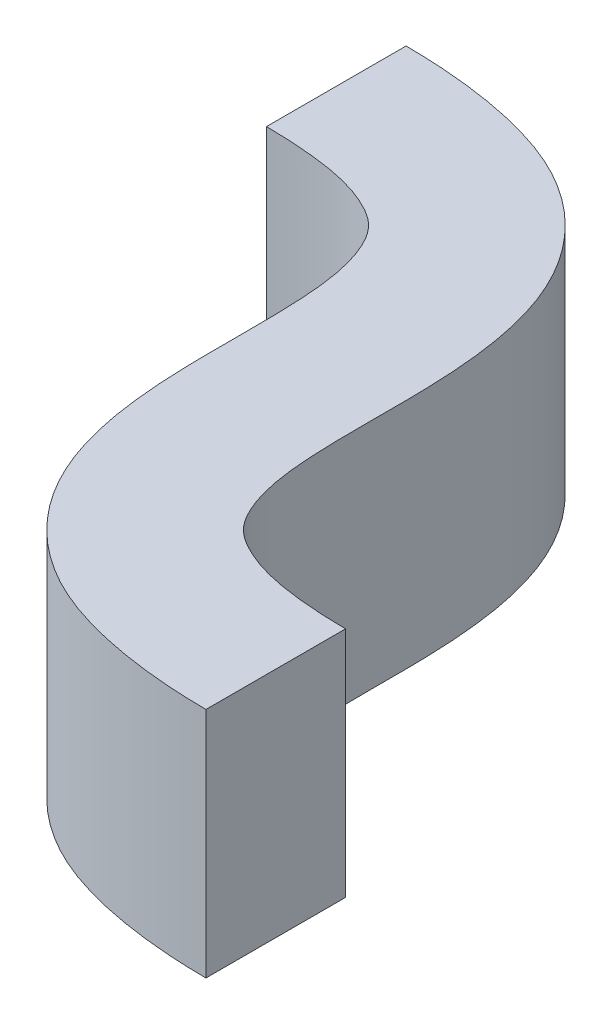
ISO-10303-21;
HEADER;
FILE_DESCRIPTION(('STEP AP214'),'2;1');
FILE_NAME('part.step','',(''),(''),'','','');
FILE_SCHEMA(('AUTOMOTIVE_DESIGN { 1 0 10303 214 1 1 1 1 }'));
ENDSEC;
DATA;
#1=APPLICATION_CONTEXT('core data for automotive mechanical design processes');
#2=APPLICATION_PROTOCOL_DEFINITION('international standard','automotive_design',2000,#1);
#3=PRODUCT_CONTEXT('',#1,'mechanical');
#4=PRODUCT('Part','Part','',(#3));
#5=PRODUCT_RELATED_PRODUCT_CATEGORY('part','',(#4));
#6=PRODUCT_DEFINITION_FORMATION('','',#4);
#7=PRODUCT_DEFINITION_CONTEXT('part definition',#1,'design');
#8=PRODUCT_DEFINITION('design','',#6,#7);
#9=PRODUCT_DEFINITION_SHAPE('','',#8);
#10=(LENGTH_UNIT() NAMED_UNIT(*) SI_UNIT(.MILLI.,.METRE.));
#11=(NAMED_UNIT(*) PLANE_ANGLE_UNIT() SI_UNIT($,.RADIAN.));
#12=(NAMED_UNIT(*) SI_UNIT($,.STERADIAN.) SOLID_ANGLE_UNIT());
#13=UNCERTAINTY_MEASURE_WITH_UNIT(LENGTH_MEASURE(1.E-05),#10,'distance_accuracy_value','');
#14=(GEOMETRIC_REPRESENTATION_CONTEXT(3) GLOBAL_UNCERTAINTY_ASSIGNED_CONTEXT((#13)) GLOBAL_UNIT_ASSIGNED_CONTEXT((#10,
#11,#12)) REPRESENTATION_CONTEXT('',''));
#15=CARTESIAN_POINT('',(0.,0.,0.));
#16=DIRECTION('',(0.,0.,1.));
#17=DIRECTION('',(1.,0.,0.));
#18=AXIS2_PLACEMENT_3D('',#15,#16,#17);
#19=CARTESIAN_POINT('',(0.,0.25,0.15));
#20=CARTESIAN_POINT('',(0.0477446697630718,0.25,0.15));
#21=CARTESIAN_POINT('',(0.155665806511138,0.25,0.157902335173896));
#22=CARTESIAN_POINT('',(0.268833811610878,0.25,0.196330026084236));
#23=CARTESIAN_POINT('',(0.321332260255017,0.25,0.245361124190905));
#24=CARTESIAN_POINT('',(0.359137106356482,0.25,0.36824001582057));
#25=CARTESIAN_POINT('',(0.360535095064994,0.25,0.5705801582386));
#26=CARTESIAN_POINT('',(0.358722513383542,0.25,0.799439351225031));
#27=CARTESIAN_POINT('',(0.418615632146775,0.25,1.05415753257306));
#28=CARTESIAN_POINT('',(0.634615227287955,0.25,1.26388883752981));
#29=CARTESIAN_POINT('',(0.899848207512551,0.25,1.3));
#30=CARTESIAN_POINT('',(1.02,0.25,1.3));
#31=B_SPLINE_CURVE_WITH_KNOTS('',3,(#19,#20,#21,#22,#23,#24,#25,#26,#27,#28,#29,#30),
.UNSPECIFIED.,.F.,.F.,(4,1,1,1,1,1,1,1,1,4),(0.,0.0625,0.125,0.25,0.375,0.5,0.625,0.75,0.875,
1.),.UNSPECIFIED.);
#32=DIRECTION('',(0.,-1.,0.));
#33=VECTOR('',#32,1.);
#34=SURFACE_OF_LINEAR_EXTRUSION('',#31,#33);
#35=CARTESIAN_POINT('',(0.,-0.25,0.15));
#36=CARTESIAN_POINT('',(0.0477446697630718,-0.25,0.15));
#37=CARTESIAN_POINT('',(0.155665806511138,-0.25,0.157902335173896));
#38=CARTESIAN_POINT('',(0.268833811610878,-0.25,0.196330026084236));
#39=CARTESIAN_POINT('',(0.321332260255017,-0.25,0.245361124190905));
#40=CARTESIAN_POINT('',(0.359137106356482,-0.25,0.36824001582057));
#41=CARTESIAN_POINT('',(0.360535095064994,-0.25,0.5705801582386));
#42=CARTESIAN_POINT('',(0.358722513383542,-0.25,0.799439351225031));
#43=CARTESIAN_POINT('',(0.418615632146775,-0.25,1.05415753257306));
#44=CARTESIAN_POINT('',(0.634615227287955,-0.25,1.26388883752981));
#45=CARTESIAN_POINT('',(0.899848207512551,-0.25,1.3));
#46=CARTESIAN_POINT('',(1.02,-0.25,1.3));
#47=B_SPLINE_CURVE_WITH_KNOTS('',3,(#35,#36,#37,#38,#39,#40,#41,#42,#43,#44,#45,#46),
.UNSPECIFIED.,.F.,.F.,(4,1,1,1,1,1,1,1,1,4),(0.,0.0625,0.125,0.25,0.375,0.5,0.625,0.75,0.875,
1.),.UNSPECIFIED.);
#48=CARTESIAN_POINT('',(0.,-0.25,0.15));
#49=VERTEX_POINT('',#48);
#50=CARTESIAN_POINT('',(1.02,-0.25,1.3));
#51=VERTEX_POINT('',#50);
#52=EDGE_CURVE('E127',#49,#51,#47,.T.);
#53=ORIENTED_EDGE('',*,*,#52,.T.);
#54=DIRECTION('',(0.,-1.,0.));
#55=VECTOR('',#54,1.);
#56=CARTESIAN_POINT('',(1.02,0.25,1.3));
#57=LINE('',#56,#55);
#58=CARTESIAN_POINT('',(1.02,0.25,1.3));
#59=VERTEX_POINT('',#58);
#60=EDGE_CURVE('E11',#59,#51,#57,.T.);
#61=ORIENTED_EDGE('',*,*,#60,.F.);
#62=CARTESIAN_POINT('',(0.,0.25,0.15));
#63=VERTEX_POINT('',#62);
#64=EDGE_CURVE('E92',#63,#59,#31,.T.);
#65=ORIENTED_EDGE('',*,*,#64,.F.);
#66=DIRECTION('',(0.,-1.,0.));
#67=VECTOR('',#66,1.);
#68=CARTESIAN_POINT('',(0.,0.25,0.15));
#69=LINE('',#68,#67);
#70=EDGE_CURVE('E104',#63,#49,#69,.T.);
#71=ORIENTED_EDGE('',*,*,#70,.T.);
#72=EDGE_LOOP('',(#53,#61,#65,#71));
#73=FACE_BOUND('',#72,.T.);
#74=ADVANCED_FACE('F39',(#73),#34,.F.);
#75=CARTESIAN_POINT('',(1.02,0.25,1.3));
#76=DIRECTION('',(-1.,0.,0.));
#77=DIRECTION('',(0.,0.,1.));
#78=AXIS2_PLACEMENT_3D('',#75,#76,#77);
#79=PLANE('',#78);
#80=DIRECTION('',(0.,0.,-1.));
#81=VECTOR('',#80,1.);
#82=CARTESIAN_POINT('',(1.02,-0.25,1.3));
#83=LINE('',#82,#81);
#84=CARTESIAN_POINT('',(1.02,-0.25,1.));
#85=VERTEX_POINT('',#84);
#86=EDGE_CURVE('E97',#51,#85,#83,.T.);
#87=ORIENTED_EDGE('',*,*,#86,.T.);
#88=DIRECTION('',(0.,-1.,0.));
#89=VECTOR('',#88,1.);
#90=CARTESIAN_POINT('',(1.02,0.25,1.));
#91=LINE('',#90,#89);
#92=CARTESIAN_POINT('',(1.02,0.25,1.));
#93=VERTEX_POINT('',#92);
#94=EDGE_CURVE('E49',#93,#85,#91,.T.);
#95=ORIENTED_EDGE('',*,*,#94,.F.);
#96=DIRECTION('',(0.,0.,-1.));
#97=VECTOR('',#96,1.);
#98=CARTESIAN_POINT('',(1.02,0.25,1.3));
#99=LINE('',#98,#97);
#100=EDGE_CURVE('E87',#59,#93,#99,.T.);
#101=ORIENTED_EDGE('',*,*,#100,.F.);
#102=ORIENTED_EDGE('',*,*,#60,.T.);
#103=EDGE_LOOP('',(#87,#95,#101,#102));
#104=FACE_BOUND('',#103,.T.);
#105=ADVANCED_FACE('F96',(#104),#79,.F.);
#106=CARTESIAN_POINT('',(1.02,0.25,1.));
#107=CARTESIAN_POINT('',(0.972255330236929,0.25,1.));
#108=CARTESIAN_POINT('',(0.864334193488862,0.25,0.992097664826104));
#109=CARTESIAN_POINT('',(0.751166188389122,0.25,0.953669973915764));
#110=CARTESIAN_POINT('',(0.698667739744984,0.25,0.904638875809096));
#111=CARTESIAN_POINT('',(0.660862893643518,0.25,0.781759984179429));
#112=CARTESIAN_POINT('',(0.659464904935006,0.25,0.5794198417614));
#113=CARTESIAN_POINT('',(0.661277486616458,0.25,0.350560648774969));
#114=CARTESIAN_POINT('',(0.601384367853225,0.25,0.0958424674269382));
#115=CARTESIAN_POINT('',(0.385384772712046,0.25,-0.113888837529812));
#116=CARTESIAN_POINT('',(0.120151792487449,0.25,-0.15));
#117=CARTESIAN_POINT('',(0.,0.25,-0.15));
#118=B_SPLINE_CURVE_WITH_KNOTS('',3,(#106,#107,#108,#109,#110,#111,#112,#113,#114,#115,#116,
#117),.UNSPECIFIED.,.F.,.F.,(4,1,1,1,1,1,1,1,1,4),(0.,0.0625,0.125,0.25,0.375,0.5,0.625,0.75,
0.875,1.),.UNSPECIFIED.);
#119=DIRECTION('',(0.,-1.,0.));
#120=VECTOR('',#119,1.);
#121=SURFACE_OF_LINEAR_EXTRUSION('',#118,#120);
#122=CARTESIAN_POINT('',(1.02,-0.25,1.));
#123=CARTESIAN_POINT('',(0.972255330236929,-0.25,1.));
#124=CARTESIAN_POINT('',(0.864334193488862,-0.25,0.992097664826104));
#125=CARTESIAN_POINT('',(0.751166188389122,-0.25,0.953669973915764));
#126=CARTESIAN_POINT('',(0.698667739744984,-0.25,0.904638875809096));
#127=CARTESIAN_POINT('',(0.660862893643518,-0.25,0.781759984179429));
#128=CARTESIAN_POINT('',(0.659464904935006,-0.25,0.5794198417614));
#129=CARTESIAN_POINT('',(0.661277486616458,-0.25,0.350560648774969));
#130=CARTESIAN_POINT('',(0.601384367853225,-0.25,0.0958424674269382));
#131=CARTESIAN_POINT('',(0.385384772712046,-0.25,-0.113888837529812));
#132=CARTESIAN_POINT('',(0.120151792487449,-0.25,-0.15));
#133=CARTESIAN_POINT('',(0.,-0.25,-0.15));
#134=B_SPLINE_CURVE_WITH_KNOTS('',3,(#122,#123,#124,#125,#126,#127,#128,#129,#130,#131,#132,
#133),.UNSPECIFIED.,.F.,.F.,(4,1,1,1,1,1,1,1,1,4),(0.,0.0625,0.125,0.25,0.375,0.5,0.625,0.75,
0.875,1.),.UNSPECIFIED.);
#135=CARTESIAN_POINT('',(0.,-0.25,-0.15));
#136=VERTEX_POINT('',#135);
#137=EDGE_CURVE('E74',#85,#136,#134,.T.);
#138=ORIENTED_EDGE('',*,*,#137,.T.);
#139=DIRECTION('',(0.,-1.,0.));
#140=VECTOR('',#139,1.);
#141=CARTESIAN_POINT('',(0.,0.25,-0.15));
#142=LINE('',#141,#140);
#143=CARTESIAN_POINT('',(0.,0.25,-0.15));
#144=VERTEX_POINT('',#143);
#145=EDGE_CURVE('E99',#144,#136,#142,.T.);
#146=ORIENTED_EDGE('',*,*,#145,.F.);
#147=EDGE_CURVE('E90',#93,#144,#118,.T.);
#148=ORIENTED_EDGE('',*,*,#147,.F.);
#149=ORIENTED_EDGE('',*,*,#94,.T.);
#150=EDGE_LOOP('',(#138,#146,#148,#149));
#151=FACE_BOUND('',#150,.T.);
#152=ADVANCED_FACE('F100',(#151),#121,.F.);
#153=CARTESIAN_POINT('',(0.,0.25,0.15));
#154=DIRECTION('',(1.,0.,0.));
#155=DIRECTION('',(0.,0.,-1.));
#156=AXIS2_PLACEMENT_3D('',#153,#154,#155);
#157=PLANE('',#156);
#158=DIRECTION('',(0.,0.,1.));
#159=VECTOR('',#158,1.);
#160=CARTESIAN_POINT('',(0.,-0.25,0.15));
#161=LINE('',#160,#159);
#162=EDGE_CURVE('E80',#136,#49,#161,.T.);
#163=ORIENTED_EDGE('',*,*,#162,.T.);
#164=ORIENTED_EDGE('',*,*,#70,.F.);
#165=DIRECTION('',(0.,0.,1.));
#166=VECTOR('',#165,1.);
#167=CARTESIAN_POINT('',(0.,0.25,0.15));
#168=LINE('',#167,#166);
#169=EDGE_CURVE('E57',#144,#63,#168,.T.);
#170=ORIENTED_EDGE('',*,*,#169,.F.);
#171=ORIENTED_EDGE('',*,*,#145,.T.);
#172=EDGE_LOOP('',(#163,#164,#170,#171));
#173=FACE_BOUND('',#172,.T.);
#174=ADVANCED_FACE('F116',(#173),#157,.F.);
#175=CARTESIAN_POINT('',(0.36,0.25,0.575));
#176=DIRECTION('',(0.,1.,0.));
#177=DIRECTION('',(0.,0.,1.));
#178=AXIS2_PLACEMENT_3D('',#175,#176,#177);
#179=PLANE('',#178);
#180=ORIENTED_EDGE('',*,*,#64,.T.);
#181=ORIENTED_EDGE('',*,*,#100,.T.);
#182=ORIENTED_EDGE('',*,*,#147,.T.);
#183=ORIENTED_EDGE('',*,*,#169,.T.);
#184=EDGE_LOOP('',(#180,#181,#182,#183));
#185=FACE_BOUND('',#184,.T.);
#186=ADVANCED_FACE('F88',(#185),#179,.T.);
#187=CARTESIAN_POINT('',(0.36,-0.25,0.575));
#188=DIRECTION('',(0.,1.,0.));
#189=DIRECTION('',(0.,0.,1.));
#190=AXIS2_PLACEMENT_3D('',#187,#188,#189);
#191=PLANE('',#190);
#192=ORIENTED_EDGE('',*,*,#52,.F.);
#193=ORIENTED_EDGE('',*,*,#162,.F.);
#194=ORIENTED_EDGE('',*,*,#137,.F.);
#195=ORIENTED_EDGE('',*,*,#86,.F.);
#196=EDGE_LOOP('',(#192,#193,#194,#195));
#197=FACE_BOUND('',#196,.T.);
#198=ADVANCED_FACE('F150',(#197),#191,.F.);
#199=CLOSED_SHELL('',(#74,#105,#152,#174,#186,#198));
#200=MANIFOLD_SOLID_BREP('B2',#199);
#201=ADVANCED_BREP_SHAPE_REPRESENTATION('',(#18,#200),#14);
#202=SHAPE_DEFINITION_REPRESENTATION(#9,#201);
ENDSEC;
END-ISO-10303-21;
